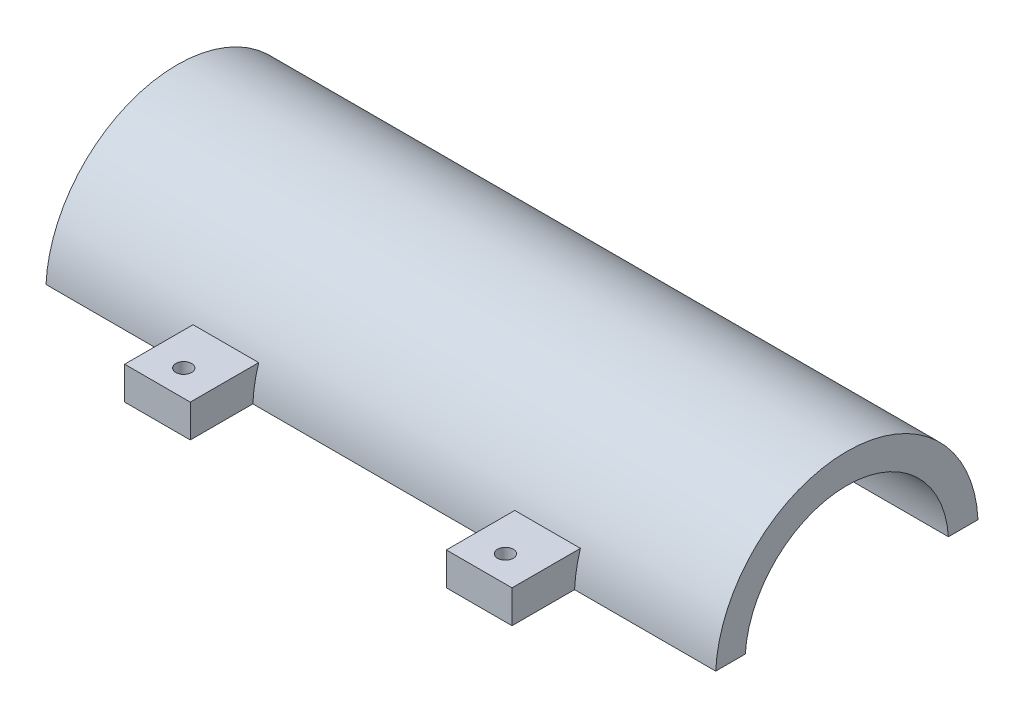
ISO-10303-21;
HEADER;
FILE_DESCRIPTION(('STEP AP214'),'2;1');
FILE_NAME('part.step','',(''),(''),'','','');
FILE_SCHEMA(('AUTOMOTIVE_DESIGN { 1 0 10303 214 1 1 1 1 }'));
ENDSEC;
DATA;
#1=APPLICATION_CONTEXT('core data for automotive mechanical design processes');
#2=APPLICATION_PROTOCOL_DEFINITION('international standard','automotive_design',2000,#1);
#3=PRODUCT_CONTEXT('',#1,'mechanical');
#4=PRODUCT('Part','Part','',(#3));
#5=PRODUCT_RELATED_PRODUCT_CATEGORY('part','',(#4));
#6=PRODUCT_DEFINITION_FORMATION('','',#4);
#7=PRODUCT_DEFINITION_CONTEXT('part definition',#1,'design');
#8=PRODUCT_DEFINITION('design','',#6,#7);
#9=PRODUCT_DEFINITION_SHAPE('','',#8);
#10=(LENGTH_UNIT() NAMED_UNIT(*) SI_UNIT(.MILLI.,.METRE.));
#11=(NAMED_UNIT(*) PLANE_ANGLE_UNIT() SI_UNIT($,.RADIAN.));
#12=(NAMED_UNIT(*) SI_UNIT($,.STERADIAN.) SOLID_ANGLE_UNIT());
#13=UNCERTAINTY_MEASURE_WITH_UNIT(LENGTH_MEASURE(1.E-05),#10,'distance_accuracy_value','');
#14=(GEOMETRIC_REPRESENTATION_CONTEXT(3) GLOBAL_UNCERTAINTY_ASSIGNED_CONTEXT((#13)) GLOBAL_UNIT_ASSIGNED_CONTEXT((#10,
#11,#12)) REPRESENTATION_CONTEXT('',''));
#15=CARTESIAN_POINT('',(0.,0.,0.));
#16=DIRECTION('',(0.,0.,1.));
#17=DIRECTION('',(1.,0.,0.));
#18=AXIS2_PLACEMENT_3D('',#15,#16,#17);
#19=CARTESIAN_POINT('',(0.,1.14590202813815,3.94518317727533));
#20=DIRECTION('',(1.,0.,0.));
#21=DIRECTION('',(0.,0.,-1.));
#22=AXIS2_PLACEMENT_3D('',#19,#20,#21);
#23=CYLINDRICAL_SURFACE('',#22,10.);
#24=CARTESIAN_POINT('',(0.,1.14590202813815,3.94518317727533));
#25=DIRECTION('',(-1.,0.,0.));
#26=DIRECTION('',(0.,0.,-1.));
#27=AXIS2_PLACEMENT_3D('',#24,#25,#26);
#28=CIRCLE('',#27,10.);
#29=CARTESIAN_POINT('',(0.,1.64590202813815,13.9326753549944));
#30=VERTEX_POINT('',#29);
#31=CARTESIAN_POINT('',(0.,1.64590202813815,-6.04230900044375));
#32=VERTEX_POINT('',#31);
#33=EDGE_CURVE('E173',#30,#32,#28,.T.);
#34=ORIENTED_EDGE('',*,*,#33,.F.);
#35=DIRECTION('',(1.,0.,0.));
#36=VECTOR('',#35,1.);
#37=CARTESIAN_POINT('',(0.,1.64590202813815,13.9326753549944));
#38=LINE('',#37,#36);
#39=CARTESIAN_POINT('',(10.75,1.64590202813815,13.9326753549944));
#40=VERTEX_POINT('',#39);
#41=EDGE_CURVE('E298',#30,#40,#38,.T.);
#42=ORIENTED_EDGE('',*,*,#41,.T.);
#43=CARTESIAN_POINT('',(10.75,1.14590202813815,3.94518317727533));
#44=DIRECTION('',(1.,0.,0.));
#45=DIRECTION('',(0.,0.,1.));
#46=AXIS2_PLACEMENT_3D('',#43,#44,#45);
#47=CIRCLE('',#46,10.);
#48=CARTESIAN_POINT('',(10.75,4.14590202813815,13.4845751914448));
#49=VERTEX_POINT('',#48);
#50=EDGE_CURVE('E278',#49,#40,#47,.T.);
#51=ORIENTED_EDGE('',*,*,#50,.F.);
#52=DIRECTION('',(1.,0.,0.));
#53=VECTOR('',#52,1.);
#54=CARTESIAN_POINT('',(0.,4.14590202813815,13.4845751914448));
#55=LINE('',#54,#53);
#56=CARTESIAN_POINT('',(15.75,4.14590202813815,13.4845751914448));
#57=VERTEX_POINT('',#56);
#58=EDGE_CURVE('E11',#49,#57,#55,.T.);
#59=ORIENTED_EDGE('',*,*,#58,.T.);
#60=CARTESIAN_POINT('',(15.75,1.14590202813815,3.94518317727533));
#61=DIRECTION('',(-1.,0.,0.));
#62=DIRECTION('',(0.,0.,-1.));
#63=AXIS2_PLACEMENT_3D('',#60,#61,#62);
#64=CIRCLE('',#63,10.);
#65=CARTESIAN_POINT('',(15.75,1.64590202813815,13.9326753549944));
#66=VERTEX_POINT('',#65);
#67=EDGE_CURVE('E273',#66,#57,#64,.T.);
#68=ORIENTED_EDGE('',*,*,#67,.F.);
#69=CARTESIAN_POINT('',(35.25,1.64590202813815,13.9326753549944));
#70=VERTEX_POINT('',#69);
#71=EDGE_CURVE('E302',#66,#70,#38,.T.);
#72=ORIENTED_EDGE('',*,*,#71,.T.);
#73=CARTESIAN_POINT('',(35.25,1.14590202813815,3.94518317727533));
#74=DIRECTION('',(1.,0.,0.));
#75=DIRECTION('',(0.,0.,1.));
#76=AXIS2_PLACEMENT_3D('',#73,#74,#75);
#77=CIRCLE('',#76,10.);
#78=CARTESIAN_POINT('',(35.25,4.14590202813815,13.4845751914448));
#79=VERTEX_POINT('',#78);
#80=EDGE_CURVE('E201',#79,#70,#77,.T.);
#81=ORIENTED_EDGE('',*,*,#80,.F.);
#82=CARTESIAN_POINT('',(40.25,4.14590202813815,13.4845751914448));
#83=VERTEX_POINT('',#82);
#84=EDGE_CURVE('E42',#79,#83,#55,.T.);
#85=ORIENTED_EDGE('',*,*,#84,.T.);
#86=CARTESIAN_POINT('',(40.25,1.14590202813815,3.94518317727533));
#87=DIRECTION('',(-1.,0.,0.));
#88=DIRECTION('',(0.,0.,-1.));
#89=AXIS2_PLACEMENT_3D('',#86,#87,#88);
#90=CIRCLE('',#89,10.);
#91=CARTESIAN_POINT('',(40.25,1.64590202813815,13.9326753549944));
#92=VERTEX_POINT('',#91);
#93=EDGE_CURVE('E198',#92,#83,#90,.T.);
#94=ORIENTED_EDGE('',*,*,#93,.F.);
#95=CARTESIAN_POINT('',(51.,1.64590202813815,13.9326753549944));
#96=VERTEX_POINT('',#95);
#97=EDGE_CURVE('E172',#92,#96,#38,.T.);
#98=ORIENTED_EDGE('',*,*,#97,.T.);
#99=CARTESIAN_POINT('',(51.,1.14590202813815,3.94518317727533));
#100=DIRECTION('',(-1.,0.,0.));
#101=DIRECTION('',(0.,0.,-1.));
#102=AXIS2_PLACEMENT_3D('',#99,#100,#101);
#103=CIRCLE('',#102,10.);
#104=CARTESIAN_POINT('',(51.,1.64590202813815,-6.04230900044374));
#105=VERTEX_POINT('',#104);
#106=EDGE_CURVE('E164',#96,#105,#103,.T.);
#107=ORIENTED_EDGE('',*,*,#106,.T.);
#108=DIRECTION('',(1.,0.,0.));
#109=VECTOR('',#108,1.);
#110=CARTESIAN_POINT('',(0.,1.64590202813815,-6.04230900044375));
#111=LINE('',#110,#109);
#112=EDGE_CURVE('E145',#105,#32,#111,.F.);
#113=ORIENTED_EDGE('',*,*,#112,.T.);
#114=EDGE_LOOP('',(#34,#42,#51,#59,#68,#72,#81,#85,#94,#98,#107,#113));
#115=FACE_BOUND('',#114,.T.);
#116=ADVANCED_FACE('F33',(#115),#23,.T.);
#117=CARTESIAN_POINT('',(0.,4.14590202813815,17.6951831772753));
#118=DIRECTION('',(0.,1.,0.));
#119=DIRECTION('',(0.,0.,1.));
#120=AXIS2_PLACEMENT_3D('',#117,#118,#119);
#121=PLANE('',#120);
#122=CARTESIAN_POINT('',(13.25,4.14590202813815,16.6951831772753));
#123=DIRECTION('',(0.,1.,0.));
#124=DIRECTION('',(0.,0.,1.));
#125=AXIS2_PLACEMENT_3D('',#122,#123,#124);
#126=CIRCLE('',#125,0.6);
#127=CARTESIAN_POINT('',(13.25,4.14590202813815,17.2951831772753));
#128=VERTEX_POINT('',#127);
#129=EDGE_CURVE('E253',#128,#128,#126,.T.);
#130=ORIENTED_EDGE('',*,*,#129,.F.);
#131=EDGE_LOOP('',(#130));
#132=FACE_BOUND('',#131,.T.);
#133=DIRECTION('',(0.,0.,-1.));
#134=VECTOR('',#133,1.);
#135=CARTESIAN_POINT('',(10.75,4.14590202813815,13.4845751914448));
#136=LINE('',#135,#134);
#137=CARTESIAN_POINT('',(10.75,4.14590202813815,18.6951831772753));
#138=VERTEX_POINT('',#137);
#139=EDGE_CURVE('E216',#138,#49,#136,.T.);
#140=ORIENTED_EDGE('',*,*,#139,.F.);
#141=DIRECTION('',(-1.,0.,0.));
#142=VECTOR('',#141,1.);
#143=CARTESIAN_POINT('',(10.75,4.14590202813815,18.6951831772753));
#144=LINE('',#143,#142);
#145=CARTESIAN_POINT('',(15.75,4.14590202813815,18.6951831772753));
#146=VERTEX_POINT('',#145);
#147=EDGE_CURVE('E261',#146,#138,#144,.T.);
#148=ORIENTED_EDGE('',*,*,#147,.F.);
#149=DIRECTION('',(0.,0.,1.));
#150=VECTOR('',#149,1.);
#151=CARTESIAN_POINT('',(15.75,4.14590202813815,17.6951831772753));
#152=LINE('',#151,#150);
#153=EDGE_CURVE('E275',#57,#146,#152,.T.);
#154=ORIENTED_EDGE('',*,*,#153,.F.);
#155=ORIENTED_EDGE('',*,*,#58,.F.);
#156=EDGE_LOOP('',(#140,#148,#154,#155));
#157=FACE_BOUND('',#156,.T.);
#158=ADVANCED_FACE('F288',(#132,#157),#121,.T.);
#159=CARTESIAN_POINT('',(37.75,4.14590202813815,16.6951831772753));
#160=DIRECTION('',(0.,1.,0.));
#161=DIRECTION('',(0.,0.,1.));
#162=AXIS2_PLACEMENT_3D('',#159,#160,#161);
#163=CIRCLE('',#162,0.6);
#164=CARTESIAN_POINT('',(37.75,4.14590202813815,17.2951831772753));
#165=VERTEX_POINT('',#164);
#166=EDGE_CURVE('E156',#165,#165,#163,.T.);
#167=ORIENTED_EDGE('',*,*,#166,.F.);
#168=EDGE_LOOP('',(#167));
#169=FACE_BOUND('',#168,.T.);
#170=ORIENTED_EDGE('',*,*,#84,.F.);
#171=DIRECTION('',(0.,0.,-1.));
#172=VECTOR('',#171,1.);
#173=CARTESIAN_POINT('',(35.25,4.14590202813815,13.4845751914448));
#174=LINE('',#173,#172);
#175=CARTESIAN_POINT('',(35.25,4.14590202813815,18.6951831772753));
#176=VERTEX_POINT('',#175);
#177=EDGE_CURVE('E271',#176,#79,#174,.T.);
#178=ORIENTED_EDGE('',*,*,#177,.F.);
#179=DIRECTION('',(-1.,0.,0.));
#180=VECTOR('',#179,1.);
#181=CARTESIAN_POINT('',(35.25,4.14590202813815,18.6951831772753));
#182=LINE('',#181,#180);
#183=CARTESIAN_POINT('',(40.25,4.14590202813815,18.6951831772753));
#184=VERTEX_POINT('',#183);
#185=EDGE_CURVE('E209',#184,#176,#182,.T.);
#186=ORIENTED_EDGE('',*,*,#185,.F.);
#187=DIRECTION('',(0.,0.,1.));
#188=VECTOR('',#187,1.);
#189=CARTESIAN_POINT('',(40.25,4.14590202813815,13.4845751914448));
#190=LINE('',#189,#188);
#191=EDGE_CURVE('E206',#83,#184,#190,.T.);
#192=ORIENTED_EDGE('',*,*,#191,.F.);
#193=EDGE_LOOP('',(#170,#178,#186,#192));
#194=FACE_BOUND('',#193,.T.);
#195=ADVANCED_FACE('F207',(#169,#194),#121,.T.);
#196=CARTESIAN_POINT('',(0.,1.14590202813815,3.94518317727533));
#197=DIRECTION('',(1.,0.,0.));
#198=DIRECTION('',(0.,0.,-1.));
#199=AXIS2_PLACEMENT_3D('',#196,#197,#198);
#200=CYLINDRICAL_SURFACE('',#199,7.75);
#201=CARTESIAN_POINT('',(51.,1.14590202813815,3.94518317727533));
#202=DIRECTION('',(1.,0.,0.));
#203=DIRECTION('',(0.,0.,-1.));
#204=AXIS2_PLACEMENT_3D('',#201,#202,#203);
#205=CIRCLE('',#204,7.75);
#206=CARTESIAN_POINT('',(51.,1.64590202813815,-3.78867097185367));
#207=VERTEX_POINT('',#206);
#208=CARTESIAN_POINT('',(51.,1.64590202813815,11.6790373264043));
#209=VERTEX_POINT('',#208);
#210=EDGE_CURVE('E166',#207,#209,#205,.T.);
#211=ORIENTED_EDGE('',*,*,#210,.T.);
#212=DIRECTION('',(1.,0.,0.));
#213=VECTOR('',#212,1.);
#214=CARTESIAN_POINT('',(0.,1.64590202813815,11.6790373264043));
#215=LINE('',#214,#213);
#216=CARTESIAN_POINT('',(0.,1.64590202813815,11.6790373264043));
#217=VERTEX_POINT('',#216);
#218=EDGE_CURVE('E303',#209,#217,#215,.F.);
#219=ORIENTED_EDGE('',*,*,#218,.T.);
#220=CARTESIAN_POINT('',(0.,1.14590202813815,3.94518317727533));
#221=DIRECTION('',(1.,0.,0.));
#222=DIRECTION('',(0.,0.,-1.));
#223=AXIS2_PLACEMENT_3D('',#220,#221,#222);
#224=CIRCLE('',#223,7.75);
#225=CARTESIAN_POINT('',(0.,1.64590202813815,-3.78867097185367));
#226=VERTEX_POINT('',#225);
#227=EDGE_CURVE('E181',#226,#217,#224,.T.);
#228=ORIENTED_EDGE('',*,*,#227,.F.);
#229=DIRECTION('',(1.,0.,0.));
#230=VECTOR('',#229,1.);
#231=CARTESIAN_POINT('',(0.,1.64590202813815,-3.78867097185367));
#232=LINE('',#231,#230);
#233=CARTESIAN_POINT('',(21.75,1.64590202813815,-3.78867097185367));
#234=VERTEX_POINT('',#233);
#235=EDGE_CURVE('E235',#226,#234,#232,.T.);
#236=ORIENTED_EDGE('',*,*,#235,.T.);
#237=CARTESIAN_POINT('',(21.75,1.14590202813815,3.94518317727533));
#238=DIRECTION('',(1.,0.,0.));
#239=DIRECTION('',(0.,0.,-1.));
#240=AXIS2_PLACEMENT_3D('',#237,#238,#239);
#241=CIRCLE('',#240,7.75);
#242=CARTESIAN_POINT('',(21.75,2.19590202813815,-3.73335835090565));
#243=VERTEX_POINT('',#242);
#244=EDGE_CURVE('E184',#243,#234,#241,.F.);
#245=ORIENTED_EDGE('',*,*,#244,.F.);
#246=DIRECTION('',(1.,0.,0.));
#247=VECTOR('',#246,1.);
#248=CARTESIAN_POINT('',(0.,2.19590202813815,-3.73335835090565));
#249=LINE('',#248,#247);
#250=CARTESIAN_POINT('',(29.25,2.19590202813815,-3.73335835090565));
#251=VERTEX_POINT('',#250);
#252=EDGE_CURVE('E190',#251,#243,#249,.F.);
#253=ORIENTED_EDGE('',*,*,#252,.F.);
#254=CARTESIAN_POINT('',(29.25,1.14590202813815,3.94518317727533));
#255=DIRECTION('',(-1.,0.,0.));
#256=DIRECTION('',(0.,0.,1.));
#257=AXIS2_PLACEMENT_3D('',#254,#255,#256);
#258=CIRCLE('',#257,7.75);
#259=CARTESIAN_POINT('',(29.25,1.64590202813815,-3.78867097185367));
#260=VERTEX_POINT('',#259);
#261=EDGE_CURVE('E188',#260,#251,#258,.F.);
#262=ORIENTED_EDGE('',*,*,#261,.F.);
#263=EDGE_CURVE('E157',#260,#207,#232,.T.);
#264=ORIENTED_EDGE('',*,*,#263,.T.);
#265=EDGE_LOOP('',(#211,#219,#228,#236,#245,#253,#262,#264));
#266=FACE_BOUND('',#265,.T.);
#267=ADVANCED_FACE('F232',(#266),#200,.F.);
#268=CARTESIAN_POINT('',(51.,0.,0.));
#269=DIRECTION('',(1.,0.,0.));
#270=DIRECTION('',(0.,0.,-1.));
#271=AXIS2_PLACEMENT_3D('',#268,#269,#270);
#272=PLANE('',#271);
#273=DIRECTION('',(0.,0.,1.));
#274=VECTOR('',#273,1.);
#275=CARTESIAN_POINT('',(51.,1.64590202813815,18.6951831772753));
#276=LINE('',#275,#274);
#277=EDGE_CURVE('E148',#105,#207,#276,.T.);
#278=ORIENTED_EDGE('',*,*,#277,.F.);
#279=ORIENTED_EDGE('',*,*,#106,.F.);
#280=EDGE_CURVE('E168',#209,#96,#276,.T.);
#281=ORIENTED_EDGE('',*,*,#280,.F.);
#282=ORIENTED_EDGE('',*,*,#210,.F.);
#283=EDGE_LOOP('',(#278,#279,#281,#282));
#284=FACE_BOUND('',#283,.T.);
#285=ADVANCED_FACE('F162',(#284),#272,.T.);
#286=CARTESIAN_POINT('',(0.,0.,0.));
#287=DIRECTION('',(1.,0.,0.));
#288=DIRECTION('',(0.,0.,-1.));
#289=AXIS2_PLACEMENT_3D('',#286,#287,#288);
#290=PLANE('',#289);
#291=ORIENTED_EDGE('',*,*,#33,.T.);
#292=DIRECTION('',(0.,0.,1.));
#293=VECTOR('',#292,1.);
#294=CARTESIAN_POINT('',(0.,1.64590202813815,0.));
#295=LINE('',#294,#293);
#296=EDGE_CURVE('E151',#32,#226,#295,.T.);
#297=ORIENTED_EDGE('',*,*,#296,.T.);
#298=ORIENTED_EDGE('',*,*,#227,.T.);
#299=EDGE_CURVE('E247',#217,#30,#295,.T.);
#300=ORIENTED_EDGE('',*,*,#299,.T.);
#301=EDGE_LOOP('',(#291,#297,#298,#300));
#302=FACE_BOUND('',#301,.T.);
#303=ADVANCED_FACE('F35',(#302),#290,.F.);
#304=CARTESIAN_POINT('',(0.,0.,-4.55481682272466));
#305=DIRECTION('',(0.,0.,1.));
#306=DIRECTION('',(0.,-1.,0.));
#307=AXIS2_PLACEMENT_3D('',#304,#305,#306);
#308=PLANE('',#307);
#309=DIRECTION('',(-1.,0.,0.));
#310=VECTOR('',#309,1.);
#311=CARTESIAN_POINT('',(0.,1.64590202813815,-4.55481682272466));
#312=LINE('',#311,#310);
#313=CARTESIAN_POINT('',(29.25,1.64590202813815,-4.55481682272466));
#314=VERTEX_POINT('',#313);
#315=CARTESIAN_POINT('',(21.75,1.64590202813815,-4.55481682272466));
#316=VERTEX_POINT('',#315);
#317=EDGE_CURVE('E49',#314,#316,#312,.T.);
#318=ORIENTED_EDGE('',*,*,#317,.F.);
#319=DIRECTION('',(0.,-1.,0.));
#320=VECTOR('',#319,1.);
#321=CARTESIAN_POINT('',(29.25,-2.18013164577437,-4.55481682272466));
#322=LINE('',#321,#320);
#323=CARTESIAN_POINT('',(29.25,2.19590202813815,-4.55481682272466));
#324=VERTEX_POINT('',#323);
#325=EDGE_CURVE('E221',#324,#314,#322,.T.);
#326=ORIENTED_EDGE('',*,*,#325,.F.);
#327=DIRECTION('',(1.,0.,0.));
#328=VECTOR('',#327,1.);
#329=CARTESIAN_POINT('',(29.25,2.19590202813815,-4.55481682272466));
#330=LINE('',#329,#328);
#331=CARTESIAN_POINT('',(21.75,2.19590202813815,-4.55481682272466));
#332=VERTEX_POINT('',#331);
#333=EDGE_CURVE('E214',#332,#324,#330,.T.);
#334=ORIENTED_EDGE('',*,*,#333,.F.);
#335=DIRECTION('',(0.,1.,0.));
#336=VECTOR('',#335,1.);
#337=CARTESIAN_POINT('',(21.75,-2.18013164577437,-4.55481682272466));
#338=LINE('',#337,#336);
#339=EDGE_CURVE('E212',#316,#332,#338,.T.);
#340=ORIENTED_EDGE('',*,*,#339,.F.);
#341=EDGE_LOOP('',(#318,#326,#334,#340));
#342=FACE_BOUND('',#341,.T.);
#343=ADVANCED_FACE('F241',(#342),#308,.T.);
#344=CARTESIAN_POINT('',(29.25,2.19590202813815,-4.55481682272466));
#345=DIRECTION('',(0.,-1.,0.));
#346=DIRECTION('',(0.,0.,-1.));
#347=AXIS2_PLACEMENT_3D('',#344,#345,#346);
#348=PLANE('',#347);
#349=ORIENTED_EDGE('',*,*,#252,.T.);
#350=DIRECTION('',(0.,0.,1.));
#351=VECTOR('',#350,1.);
#352=CARTESIAN_POINT('',(21.75,2.19590202813815,-4.55481682272466));
#353=LINE('',#352,#351);
#354=EDGE_CURVE('E174',#332,#243,#353,.T.);
#355=ORIENTED_EDGE('',*,*,#354,.F.);
#356=ORIENTED_EDGE('',*,*,#333,.T.);
#357=DIRECTION('',(0.,0.,1.));
#358=VECTOR('',#357,1.);
#359=CARTESIAN_POINT('',(29.25,2.19590202813815,-4.55481682272466));
#360=LINE('',#359,#358);
#361=EDGE_CURVE('E178',#324,#251,#360,.T.);
#362=ORIENTED_EDGE('',*,*,#361,.T.);
#363=EDGE_LOOP('',(#349,#355,#356,#362));
#364=FACE_BOUND('',#363,.T.);
#365=ADVANCED_FACE('F225',(#364),#348,.T.);
#366=CARTESIAN_POINT('',(29.25,-2.18013164577437,-4.55481682272466));
#367=DIRECTION('',(-1.,0.,0.));
#368=DIRECTION('',(0.,0.,1.));
#369=AXIS2_PLACEMENT_3D('',#366,#367,#368);
#370=PLANE('',#369);
#371=DIRECTION('',(0.,0.,-1.));
#372=VECTOR('',#371,1.);
#373=CARTESIAN_POINT('',(29.25,1.64590202813815,-4.55481682272466));
#374=LINE('',#373,#372);
#375=EDGE_CURVE('E244',#260,#314,#374,.T.);
#376=ORIENTED_EDGE('',*,*,#375,.F.);
#377=ORIENTED_EDGE('',*,*,#261,.T.);
#378=ORIENTED_EDGE('',*,*,#361,.F.);
#379=ORIENTED_EDGE('',*,*,#325,.T.);
#380=EDGE_LOOP('',(#376,#377,#378,#379));
#381=FACE_BOUND('',#380,.T.);
#382=ADVANCED_FACE('F243',(#381),#370,.T.);
#383=CARTESIAN_POINT('',(21.75,-2.18013164577437,-4.55481682272466));
#384=DIRECTION('',(1.,0.,0.));
#385=DIRECTION('',(0.,0.,-1.));
#386=AXIS2_PLACEMENT_3D('',#383,#384,#385);
#387=PLANE('',#386);
#388=DIRECTION('',(0.,0.,1.));
#389=VECTOR('',#388,1.);
#390=CARTESIAN_POINT('',(21.75,1.64590202813815,-4.55481682272466));
#391=LINE('',#390,#389);
#392=EDGE_CURVE('E238',#316,#234,#391,.T.);
#393=ORIENTED_EDGE('',*,*,#392,.F.);
#394=ORIENTED_EDGE('',*,*,#339,.T.);
#395=ORIENTED_EDGE('',*,*,#354,.T.);
#396=ORIENTED_EDGE('',*,*,#244,.T.);
#397=EDGE_LOOP('',(#393,#394,#395,#396));
#398=FACE_BOUND('',#397,.T.);
#399=ADVANCED_FACE('F237',(#398),#387,.T.);
#400=CARTESIAN_POINT('',(40.25,1.14590202813815,3.94518317727533));
#401=DIRECTION('',(1.,0.,0.));
#402=DIRECTION('',(0.,0.,-1.));
#403=AXIS2_PLACEMENT_3D('',#400,#401,#402);
#404=PLANE('',#403);
#405=DIRECTION('',(0.,0.,1.));
#406=VECTOR('',#405,1.);
#407=CARTESIAN_POINT('',(40.25,1.64590202813815,3.94518317727533));
#408=LINE('',#407,#406);
#409=CARTESIAN_POINT('',(40.25,1.64590202813815,18.6951831772753));
#410=VERTEX_POINT('',#409);
#411=EDGE_CURVE('E308',#92,#410,#408,.T.);
#412=ORIENTED_EDGE('',*,*,#411,.F.);
#413=ORIENTED_EDGE('',*,*,#93,.T.);
#414=ORIENTED_EDGE('',*,*,#191,.T.);
#415=DIRECTION('',(0.,1.,0.));
#416=VECTOR('',#415,1.);
#417=CARTESIAN_POINT('',(40.25,-1.85409797186185,18.6951831772753));
#418=LINE('',#417,#416);
#419=EDGE_CURVE('E267',#410,#184,#418,.T.);
#420=ORIENTED_EDGE('',*,*,#419,.F.);
#421=EDGE_LOOP('',(#412,#413,#414,#420));
#422=FACE_BOUND('',#421,.T.);
#423=ADVANCED_FACE('F357',(#422),#404,.T.);
#424=CARTESIAN_POINT('',(10.75,1.14590202813815,3.94518317727533));
#425=DIRECTION('',(-1.,0.,0.));
#426=DIRECTION('',(0.,0.,1.));
#427=AXIS2_PLACEMENT_3D('',#424,#425,#426);
#428=PLANE('',#427);
#429=DIRECTION('',(0.,0.,-1.));
#430=VECTOR('',#429,1.);
#431=CARTESIAN_POINT('',(10.75,1.64590202813815,3.94518317727533));
#432=LINE('',#431,#430);
#433=CARTESIAN_POINT('',(10.75,1.64590202813815,18.6951831772753));
#434=VERTEX_POINT('',#433);
#435=EDGE_CURVE('E300',#434,#40,#432,.T.);
#436=ORIENTED_EDGE('',*,*,#435,.F.);
#437=DIRECTION('',(0.,-1.,0.));
#438=VECTOR('',#437,1.);
#439=CARTESIAN_POINT('',(10.75,-1.85409797186185,18.6951831772753));
#440=LINE('',#439,#438);
#441=EDGE_CURVE('E256',#138,#434,#440,.T.);
#442=ORIENTED_EDGE('',*,*,#441,.F.);
#443=ORIENTED_EDGE('',*,*,#139,.T.);
#444=ORIENTED_EDGE('',*,*,#50,.T.);
#445=EDGE_LOOP('',(#436,#442,#443,#444));
#446=FACE_BOUND('',#445,.T.);
#447=ADVANCED_FACE('F284',(#446),#428,.T.);
#448=CARTESIAN_POINT('',(15.75,1.14590202813815,3.94518317727533));
#449=DIRECTION('',(1.,0.,0.));
#450=DIRECTION('',(0.,0.,-1.));
#451=AXIS2_PLACEMENT_3D('',#448,#449,#450);
#452=PLANE('',#451);
#453=DIRECTION('',(0.,0.,1.));
#454=VECTOR('',#453,1.);
#455=CARTESIAN_POINT('',(15.75,1.64590202813815,3.94518317727533));
#456=LINE('',#455,#454);
#457=CARTESIAN_POINT('',(15.75,1.64590202813815,18.6951831772753));
#458=VERTEX_POINT('',#457);
#459=EDGE_CURVE('E57',#66,#458,#456,.T.);
#460=ORIENTED_EDGE('',*,*,#459,.F.);
#461=ORIENTED_EDGE('',*,*,#67,.T.);
#462=ORIENTED_EDGE('',*,*,#153,.T.);
#463=DIRECTION('',(0.,1.,0.));
#464=VECTOR('',#463,1.);
#465=CARTESIAN_POINT('',(15.75,-1.85409797186185,18.6951831772753));
#466=LINE('',#465,#464);
#467=EDGE_CURVE('E259',#458,#146,#466,.T.);
#468=ORIENTED_EDGE('',*,*,#467,.F.);
#469=EDGE_LOOP('',(#460,#461,#462,#468));
#470=FACE_BOUND('',#469,.T.);
#471=ADVANCED_FACE('F295',(#470),#452,.T.);
#472=CARTESIAN_POINT('',(35.25,1.14590202813815,3.94518317727533));
#473=DIRECTION('',(-1.,0.,0.));
#474=DIRECTION('',(0.,0.,1.));
#475=AXIS2_PLACEMENT_3D('',#472,#473,#474);
#476=PLANE('',#475);
#477=DIRECTION('',(0.,0.,-1.));
#478=VECTOR('',#477,1.);
#479=CARTESIAN_POINT('',(35.25,1.64590202813815,3.94518317727533));
#480=LINE('',#479,#478);
#481=CARTESIAN_POINT('',(35.25,1.64590202813815,18.6951831772753));
#482=VERTEX_POINT('',#481);
#483=EDGE_CURVE('E307',#482,#70,#480,.T.);
#484=ORIENTED_EDGE('',*,*,#483,.F.);
#485=DIRECTION('',(0.,-1.,0.));
#486=VECTOR('',#485,1.);
#487=CARTESIAN_POINT('',(35.25,-1.85409797186185,18.6951831772753));
#488=LINE('',#487,#486);
#489=EDGE_CURVE('E264',#176,#482,#488,.T.);
#490=ORIENTED_EDGE('',*,*,#489,.F.);
#491=ORIENTED_EDGE('',*,*,#177,.T.);
#492=ORIENTED_EDGE('',*,*,#80,.T.);
#493=EDGE_LOOP('',(#484,#490,#491,#492));
#494=FACE_BOUND('',#493,.T.);
#495=ADVANCED_FACE('F384',(#494),#476,.T.);
#496=CARTESIAN_POINT('',(0.,0.,18.6951831772753));
#497=DIRECTION('',(0.,0.,-1.));
#498=DIRECTION('',(-1.,0.,0.));
#499=AXIS2_PLACEMENT_3D('',#496,#497,#498);
#500=PLANE('',#499);
#501=ORIENTED_EDGE('',*,*,#489,.T.);
#502=DIRECTION('',(1.,0.,0.));
#503=VECTOR('',#502,1.);
#504=CARTESIAN_POINT('',(-9.,1.64590202813815,18.6951831772753));
#505=LINE('',#504,#503);
#506=EDGE_CURVE('E167',#482,#410,#505,.T.);
#507=ORIENTED_EDGE('',*,*,#506,.T.);
#508=ORIENTED_EDGE('',*,*,#419,.T.);
#509=ORIENTED_EDGE('',*,*,#185,.T.);
#510=EDGE_LOOP('',(#501,#507,#508,#509));
#511=FACE_BOUND('',#510,.T.);
#512=ADVANCED_FACE('F391',(#511),#500,.F.);
#513=CARTESIAN_POINT('',(0.,0.,18.6951831772753));
#514=DIRECTION('',(0.,0.,-1.));
#515=DIRECTION('',(-1.,0.,0.));
#516=AXIS2_PLACEMENT_3D('',#513,#514,#515);
#517=PLANE('',#516);
#518=ORIENTED_EDGE('',*,*,#441,.T.);
#519=EDGE_CURVE('E293',#434,#458,#505,.T.);
#520=ORIENTED_EDGE('',*,*,#519,.T.);
#521=ORIENTED_EDGE('',*,*,#467,.T.);
#522=ORIENTED_EDGE('',*,*,#147,.T.);
#523=EDGE_LOOP('',(#518,#520,#521,#522));
#524=FACE_BOUND('',#523,.T.);
#525=ADVANCED_FACE('F291',(#524),#517,.F.);
#526=CARTESIAN_POINT('',(13.25,-15.8540979718618,16.6951831772753));
#527=DIRECTION('',(0.,1.,0.));
#528=DIRECTION('',(0.,0.,1.));
#529=AXIS2_PLACEMENT_3D('',#526,#527,#528);
#530=CYLINDRICAL_SURFACE('',#529,0.6);
#531=CARTESIAN_POINT('',(13.25,1.64590202813815,16.6951831772753));
#532=DIRECTION('',(0.,1.,0.));
#533=DIRECTION('',(0.,0.,1.));
#534=AXIS2_PLACEMENT_3D('',#531,#532,#533);
#535=CIRCLE('',#534,0.6);
#536=CARTESIAN_POINT('',(13.25,1.64590202813815,17.2951831772753));
#537=VERTEX_POINT('',#536);
#538=EDGE_CURVE('E546',#537,#537,#535,.F.);
#539=ORIENTED_EDGE('',*,*,#538,.T.);
#540=EDGE_LOOP('',(#539));
#541=FACE_BOUND('',#540,.T.);
#542=ORIENTED_EDGE('',*,*,#129,.T.);
#543=EDGE_LOOP('',(#542));
#544=FACE_BOUND('',#543,.T.);
#545=ADVANCED_FACE('F326',(#541,#544),#530,.F.);
#546=CARTESIAN_POINT('',(37.75,-15.8540979718618,16.6951831772753));
#547=DIRECTION('',(0.,1.,0.));
#548=DIRECTION('',(0.,0.,1.));
#549=AXIS2_PLACEMENT_3D('',#546,#547,#548);
#550=CYLINDRICAL_SURFACE('',#549,0.6);
#551=CARTESIAN_POINT('',(37.75,1.64590202813815,16.6951831772753));
#552=DIRECTION('',(0.,1.,0.));
#553=DIRECTION('',(0.,0.,1.));
#554=AXIS2_PLACEMENT_3D('',#551,#552,#553);
#555=CIRCLE('',#554,0.6);
#556=CARTESIAN_POINT('',(37.75,1.64590202813815,17.2951831772753));
#557=VERTEX_POINT('',#556);
#558=EDGE_CURVE('E37',#557,#557,#555,.F.);
#559=ORIENTED_EDGE('',*,*,#558,.T.);
#560=EDGE_LOOP('',(#559));
#561=FACE_BOUND('',#560,.T.);
#562=ORIENTED_EDGE('',*,*,#166,.T.);
#563=EDGE_LOOP('',(#562));
#564=FACE_BOUND('',#563,.T.);
#565=ADVANCED_FACE('F318',(#561,#564),#550,.F.);
#566=CARTESIAN_POINT('',(-9.,1.64590202813815,18.6951831772753));
#567=DIRECTION('',(0.,1.,0.));
#568=DIRECTION('',(0.,0.,1.));
#569=AXIS2_PLACEMENT_3D('',#566,#567,#568);
#570=PLANE('',#569);
#571=ORIENTED_EDGE('',*,*,#558,.F.);
#572=EDGE_LOOP('',(#571));
#573=FACE_BOUND('',#572,.T.);
#574=ORIENTED_EDGE('',*,*,#538,.F.);
#575=EDGE_LOOP('',(#574));
#576=FACE_BOUND('',#575,.T.);
#577=ORIENTED_EDGE('',*,*,#411,.T.);
#578=ORIENTED_EDGE('',*,*,#506,.F.);
#579=ORIENTED_EDGE('',*,*,#483,.T.);
#580=ORIENTED_EDGE('',*,*,#71,.F.);
#581=ORIENTED_EDGE('',*,*,#459,.T.);
#582=ORIENTED_EDGE('',*,*,#519,.F.);
#583=ORIENTED_EDGE('',*,*,#435,.T.);
#584=ORIENTED_EDGE('',*,*,#41,.F.);
#585=ORIENTED_EDGE('',*,*,#299,.F.);
#586=ORIENTED_EDGE('',*,*,#218,.F.);
#587=ORIENTED_EDGE('',*,*,#280,.T.);
#588=ORIENTED_EDGE('',*,*,#97,.F.);
#589=EDGE_LOOP('',(#577,#578,#579,#580,#581,#582,#583,#584,#585,#586,#587,#588));
#590=FACE_BOUND('',#589,.T.);
#591=ADVANCED_FACE('F316',(#573,#576,#590),#570,.F.);
#592=ORIENTED_EDGE('',*,*,#277,.T.);
#593=ORIENTED_EDGE('',*,*,#263,.F.);
#594=ORIENTED_EDGE('',*,*,#375,.T.);
#595=ORIENTED_EDGE('',*,*,#317,.T.);
#596=ORIENTED_EDGE('',*,*,#392,.T.);
#597=ORIENTED_EDGE('',*,*,#235,.F.);
#598=ORIENTED_EDGE('',*,*,#296,.F.);
#599=ORIENTED_EDGE('',*,*,#112,.F.);
#600=EDGE_LOOP('',(#592,#593,#594,#595,#596,#597,#598,#599));
#601=FACE_BOUND('',#600,.T.);
#602=ADVANCED_FACE('F147',(#601),#570,.F.);
#603=CLOSED_SHELL('',(#116,#158,#195,#267,#285,#303,#343,#365,#382,#399,#423,#447,#471,#495,
#512,#525,#545,#565,#591,#602));
#604=MANIFOLD_SOLID_BREP('B2',#603);
#605=ADVANCED_BREP_SHAPE_REPRESENTATION('',(#18,#604),#14);
#606=SHAPE_DEFINITION_REPRESENTATION(#9,#605);
ENDSEC;
END-ISO-10303-21;
